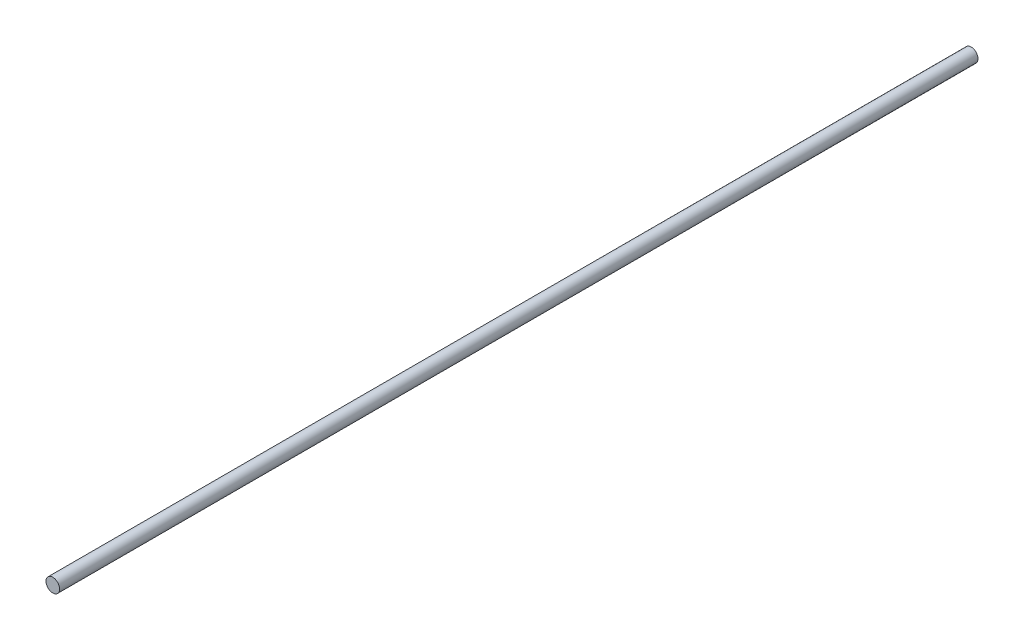
ISO-10303-21;
HEADER;
FILE_DESCRIPTION(('STEP AP214'),'2;1');
FILE_NAME('part.step','',(''),(''),'','','');
FILE_SCHEMA(('AUTOMOTIVE_DESIGN { 1 0 10303 214 1 1 1 1 }'));
ENDSEC;
DATA;
#1=APPLICATION_CONTEXT('core data for automotive mechanical design processes');
#2=APPLICATION_PROTOCOL_DEFINITION('international standard','automotive_design',2000,#1);
#3=PRODUCT_CONTEXT('',#1,'mechanical');
#4=PRODUCT('Part','Part','',(#3));
#5=PRODUCT_RELATED_PRODUCT_CATEGORY('part','',(#4));
#6=PRODUCT_DEFINITION_FORMATION('','',#4);
#7=PRODUCT_DEFINITION_CONTEXT('part definition',#1,'design');
#8=PRODUCT_DEFINITION('design','',#6,#7);
#9=PRODUCT_DEFINITION_SHAPE('','',#8);
#10=(LENGTH_UNIT() NAMED_UNIT(*) SI_UNIT(.MILLI.,.METRE.));
#11=(NAMED_UNIT(*) PLANE_ANGLE_UNIT() SI_UNIT($,.RADIAN.));
#12=(NAMED_UNIT(*) SI_UNIT($,.STERADIAN.) SOLID_ANGLE_UNIT());
#13=UNCERTAINTY_MEASURE_WITH_UNIT(LENGTH_MEASURE(1.E-05),#10,'distance_accuracy_value','');
#14=(GEOMETRIC_REPRESENTATION_CONTEXT(3) GLOBAL_UNCERTAINTY_ASSIGNED_CONTEXT((#13)) GLOBAL_UNIT_ASSIGNED_CONTEXT((#10,
#11,#12)) REPRESENTATION_CONTEXT('',''));
#15=CARTESIAN_POINT('',(0.,0.,0.));
#16=DIRECTION('',(0.,0.,1.));
#17=DIRECTION('',(1.,0.,0.));
#18=AXIS2_PLACEMENT_3D('',#15,#16,#17);
#19=CARTESIAN_POINT('',(0.,0.,-540.));
#20=DIRECTION('',(0.,0.,1.));
#21=DIRECTION('',(1.,0.,0.));
#22=AXIS2_PLACEMENT_3D('',#19,#20,#21);
#23=CYLINDRICAL_SURFACE('',#22,4.);
#24=CARTESIAN_POINT('',(0.,0.,-540.));
#25=DIRECTION('',(0.,0.,1.));
#26=DIRECTION('',(1.,0.,0.));
#27=AXIS2_PLACEMENT_3D('',#24,#25,#26);
#28=CIRCLE('',#27,4.);
#29=CARTESIAN_POINT('',(4.,0.,-540.));
#30=VERTEX_POINT('',#29);
#31=EDGE_CURVE('E10',#30,#30,#28,.T.);
#32=ORIENTED_EDGE('',*,*,#31,.T.);
#33=EDGE_LOOP('',(#32));
#34=FACE_BOUND('',#33,.T.);
#35=CARTESIAN_POINT('',(0.,0.,0.));
#36=DIRECTION('',(0.,0.,1.));
#37=DIRECTION('',(1.,0.,0.));
#38=AXIS2_PLACEMENT_3D('',#35,#36,#37);
#39=CIRCLE('',#38,4.);
#40=CARTESIAN_POINT('',(4.,0.,0.));
#41=VERTEX_POINT('',#40);
#42=EDGE_CURVE('E34',#41,#41,#39,.T.);
#43=ORIENTED_EDGE('',*,*,#42,.F.);
#44=EDGE_LOOP('',(#43));
#45=FACE_BOUND('',#44,.T.);
#46=ADVANCED_FACE('F31',(#34,#45),#23,.T.);
#47=CARTESIAN_POINT('',(0.,0.,-540.));
#48=DIRECTION('',(0.,0.,1.));
#49=DIRECTION('',(1.,0.,0.));
#50=AXIS2_PLACEMENT_3D('',#47,#48,#49);
#51=PLANE('',#50);
#52=ORIENTED_EDGE('',*,*,#31,.F.);
#53=EDGE_LOOP('',(#52));
#54=FACE_BOUND('',#53,.T.);
#55=ADVANCED_FACE('F46',(#54),#51,.F.);
#56=CARTESIAN_POINT('',(0.,0.,0.));
#57=DIRECTION('',(0.,0.,1.));
#58=DIRECTION('',(1.,0.,0.));
#59=AXIS2_PLACEMENT_3D('',#56,#57,#58);
#60=PLANE('',#59);
#61=ORIENTED_EDGE('',*,*,#42,.T.);
#62=EDGE_LOOP('',(#61));
#63=FACE_BOUND('',#62,.T.);
#64=ADVANCED_FACE('F43',(#63),#60,.T.);
#65=CLOSED_SHELL('',(#46,#55,#64));
#66=MANIFOLD_SOLID_BREP('B2',#65);
#67=ADVANCED_BREP_SHAPE_REPRESENTATION('',(#18,#66),#14);
#68=SHAPE_DEFINITION_REPRESENTATION(#9,#67);
ENDSEC;
END-ISO-10303-21;
